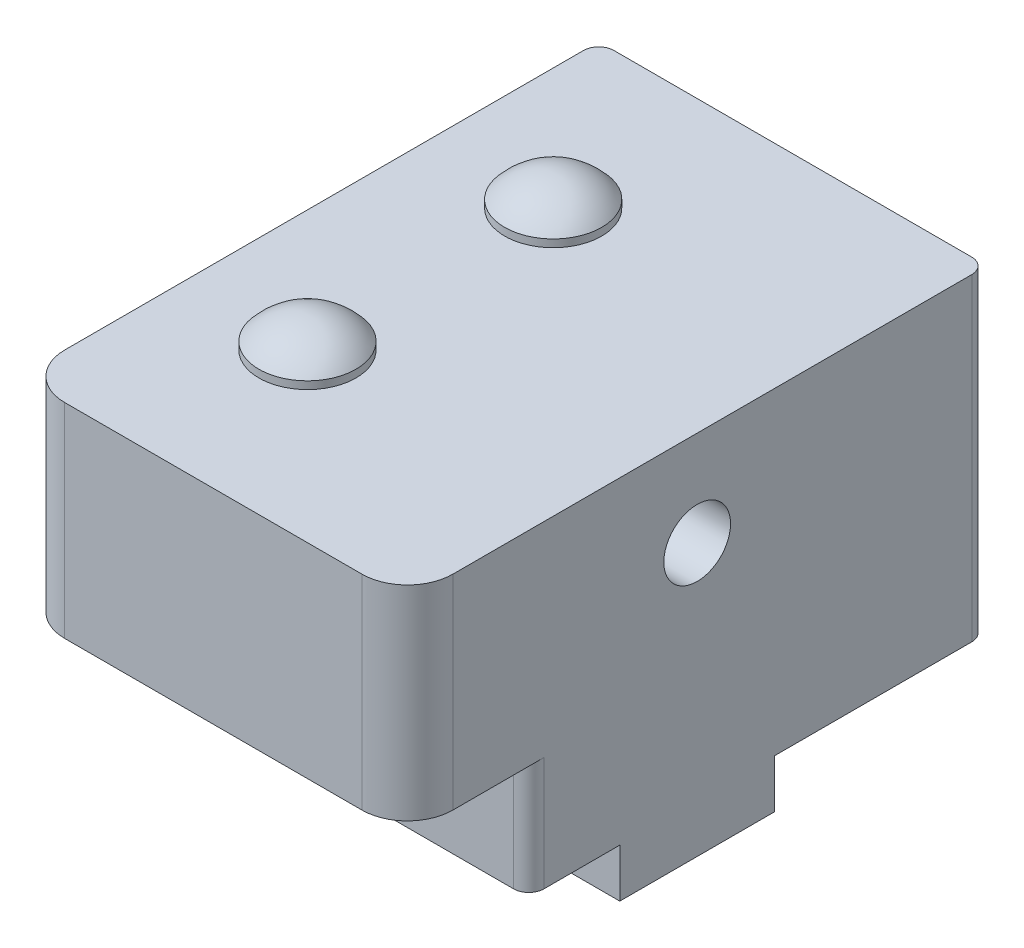
ISO-10303-21;
HEADER;
FILE_DESCRIPTION(('STEP AP214'),'2;1');
FILE_NAME('part.step','',(''),(''),'','','');
FILE_SCHEMA(('AUTOMOTIVE_DESIGN { 1 0 10303 214 1 1 1 1 }'));
ENDSEC;
DATA;
#1=APPLICATION_CONTEXT('core data for automotive mechanical design processes');
#2=APPLICATION_PROTOCOL_DEFINITION('international standard','automotive_design',2000,#1);
#3=PRODUCT_CONTEXT('',#1,'mechanical');
#4=PRODUCT('Part','Part','',(#3));
#5=PRODUCT_RELATED_PRODUCT_CATEGORY('part','',(#4));
#6=PRODUCT_DEFINITION_FORMATION('','',#4);
#7=PRODUCT_DEFINITION_CONTEXT('part definition',#1,'design');
#8=PRODUCT_DEFINITION('design','',#6,#7);
#9=PRODUCT_DEFINITION_SHAPE('','',#8);
#10=(LENGTH_UNIT() NAMED_UNIT(*) SI_UNIT(.MILLI.,.METRE.));
#11=(NAMED_UNIT(*) PLANE_ANGLE_UNIT() SI_UNIT($,.RADIAN.));
#12=(NAMED_UNIT(*) SI_UNIT($,.STERADIAN.) SOLID_ANGLE_UNIT());
#13=UNCERTAINTY_MEASURE_WITH_UNIT(LENGTH_MEASURE(1.E-05),#10,'distance_accuracy_value','');
#14=(GEOMETRIC_REPRESENTATION_CONTEXT(3) GLOBAL_UNCERTAINTY_ASSIGNED_CONTEXT((#13)) GLOBAL_UNIT_ASSIGNED_CONTEXT((#10,
#11,#12)) REPRESENTATION_CONTEXT('',''));
#15=CARTESIAN_POINT('',(0.,0.,0.));
#16=DIRECTION('',(0.,0.,1.));
#17=DIRECTION('',(1.,0.,0.));
#18=AXIS2_PLACEMENT_3D('',#15,#16,#17);
#19=CARTESIAN_POINT('',(0.,0.,0.));
#20=DIRECTION('',(0.,-1.,0.));
#21=DIRECTION('',(0.,0.,-1.));
#22=AXIS2_PLACEMENT_3D('',#19,#20,#21);
#23=PLANE('',#22);
#24=DIRECTION('',(1.,0.,0.));
#25=VECTOR('',#24,1.);
#26=CARTESIAN_POINT('',(0.,0.,-8.));
#27=LINE('',#26,#25);
#28=CARTESIAN_POINT('',(1.,0.,-8.));
#29=VERTEX_POINT('',#28);
#30=CARTESIAN_POINT('',(24.59,0.,-8.));
#31=VERTEX_POINT('',#30);
#32=EDGE_CURVE('E168',#29,#31,#27,.T.);
#33=ORIENTED_EDGE('',*,*,#32,.F.);
#34=CARTESIAN_POINT('',(1.,0.,-9.));
#35=DIRECTION('',(0.,-1.,0.));
#36=DIRECTION('',(0.,0.,-1.));
#37=AXIS2_PLACEMENT_3D('',#34,#35,#36);
#38=CIRCLE('',#37,1.);
#39=CARTESIAN_POINT('',(0.,0.,-9.));
#40=VERTEX_POINT('',#39);
#41=EDGE_CURVE('E193',#29,#40,#38,.T.);
#42=ORIENTED_EDGE('',*,*,#41,.T.);
#43=DIRECTION('',(0.,0.,1.));
#44=VECTOR('',#43,1.);
#45=CARTESIAN_POINT('',(0.,0.,0.));
#46=LINE('',#45,#44);
#47=CARTESIAN_POINT('',(0.,0.,-14.));
#48=VERTEX_POINT('',#47);
#49=EDGE_CURVE('E268',#48,#40,#46,.T.);
#50=ORIENTED_EDGE('',*,*,#49,.F.);
#51=DIRECTION('',(-1.,0.,0.));
#52=VECTOR('',#51,1.);
#53=CARTESIAN_POINT('',(0.,0.,-14.));
#54=LINE('',#53,#52);
#55=CARTESIAN_POINT('',(25.59,0.,-14.));
#56=VERTEX_POINT('',#55);
#57=EDGE_CURVE('E241',#56,#48,#54,.T.);
#58=ORIENTED_EDGE('',*,*,#57,.F.);
#59=DIRECTION('',(0.,0.,-1.));
#60=VECTOR('',#59,1.);
#61=CARTESIAN_POINT('',(25.59,0.,0.));
#62=LINE('',#61,#60);
#63=CARTESIAN_POINT('',(25.59,0.,-9.));
#64=VERTEX_POINT('',#63);
#65=EDGE_CURVE('E284',#64,#56,#62,.T.);
#66=ORIENTED_EDGE('',*,*,#65,.F.);
#67=CARTESIAN_POINT('',(24.59,0.,-9.));
#68=DIRECTION('',(0.,-1.,0.));
#69=DIRECTION('',(0.,0.,-1.));
#70=AXIS2_PLACEMENT_3D('',#67,#68,#69);
#71=CIRCLE('',#70,1.);
#72=EDGE_CURVE('E191',#64,#31,#71,.T.);
#73=ORIENTED_EDGE('',*,*,#72,.T.);
#74=EDGE_LOOP('',(#33,#42,#50,#58,#66,#73));
#75=FACE_BOUND('',#74,.T.);
#76=ADVANCED_FACE('F34',(#75),#23,.T.);
#77=CARTESIAN_POINT('',(0.,20.97,0.));
#78=DIRECTION('',(1.,0.,0.));
#79=DIRECTION('',(0.,0.,-1.));
#80=AXIS2_PLACEMENT_3D('',#77,#78,#79);
#81=PLANE('',#80);
#82=CARTESIAN_POINT('',(0.,14.7,-19.1));
#83=DIRECTION('',(1.,0.,0.));
#84=DIRECTION('',(0.,0.,-1.));
#85=AXIS2_PLACEMENT_3D('',#82,#83,#84);
#86=CIRCLE('',#85,2.2);
#87=CARTESIAN_POINT('',(0.,14.7,-21.3));
#88=VERTEX_POINT('',#87);
#89=EDGE_CURVE('E238',#88,#88,#86,.F.);
#90=ORIENTED_EDGE('',*,*,#89,.F.);
#91=EDGE_LOOP('',(#90));
#92=FACE_BOUND('',#91,.T.);
#93=ORIENTED_EDGE('',*,*,#49,.T.);
#94=DIRECTION('',(0.,-1.,0.));
#95=VECTOR('',#94,1.);
#96=CARTESIAN_POINT('',(0.,20.97,-9.));
#97=LINE('',#96,#95);
#98=CARTESIAN_POINT('',(0.,7.5,-9.));
#99=VERTEX_POINT('',#98);
#100=EDGE_CURVE('E165',#40,#99,#97,.F.);
#101=ORIENTED_EDGE('',*,*,#100,.T.);
#102=DIRECTION('',(0.,0.,-1.));
#103=VECTOR('',#102,1.);
#104=CARTESIAN_POINT('',(0.,7.5,-8.));
#105=LINE('',#104,#103);
#106=CARTESIAN_POINT('',(0.,7.5,-3.));
#107=VERTEX_POINT('',#106);
#108=EDGE_CURVE('E59',#107,#99,#105,.T.);
#109=ORIENTED_EDGE('',*,*,#108,.F.);
#110=DIRECTION('',(0.,-1.,0.));
#111=VECTOR('',#110,1.);
#112=CARTESIAN_POINT('',(0.,20.97,-3.));
#113=LINE('',#112,#111);
#114=CARTESIAN_POINT('',(0.,20.97,-3.));
#115=VERTEX_POINT('',#114);
#116=EDGE_CURVE('E162',#107,#115,#113,.F.);
#117=ORIENTED_EDGE('',*,*,#116,.T.);
#118=DIRECTION('',(0.,0.,1.));
#119=VECTOR('',#118,1.);
#120=CARTESIAN_POINT('',(0.,20.97,0.));
#121=LINE('',#120,#119);
#122=CARTESIAN_POINT('',(0.,20.97,-37.2));
#123=VERTEX_POINT('',#122);
#124=EDGE_CURVE('E269',#123,#115,#121,.T.);
#125=ORIENTED_EDGE('',*,*,#124,.F.);
#126=DIRECTION('',(0.,-1.,0.));
#127=VECTOR('',#126,1.);
#128=CARTESIAN_POINT('',(0.,20.97,-37.2));
#129=LINE('',#128,#127);
#130=CARTESIAN_POINT('',(0.,0.,-37.2));
#131=VERTEX_POINT('',#130);
#132=EDGE_CURVE('E297',#123,#131,#129,.T.);
#133=ORIENTED_EDGE('',*,*,#132,.T.);
#134=CARTESIAN_POINT('',(0.,0.,-24.2));
#135=VERTEX_POINT('',#134);
#136=EDGE_CURVE('E281',#131,#135,#46,.T.);
#137=ORIENTED_EDGE('',*,*,#136,.T.);
#138=DIRECTION('',(0.,1.,0.));
#139=VECTOR('',#138,1.);
#140=CARTESIAN_POINT('',(0.,-3.2,-24.2));
#141=LINE('',#140,#139);
#142=CARTESIAN_POINT('',(0.,-3.2,-24.2));
#143=VERTEX_POINT('',#142);
#144=EDGE_CURVE('E262',#143,#135,#141,.T.);
#145=ORIENTED_EDGE('',*,*,#144,.F.);
#146=DIRECTION('',(0.,0.,-1.));
#147=VECTOR('',#146,1.);
#148=CARTESIAN_POINT('',(0.,-3.2,-24.2));
#149=LINE('',#148,#147);
#150=CARTESIAN_POINT('',(0.,-3.2,-14.));
#151=VERTEX_POINT('',#150);
#152=EDGE_CURVE('E245',#151,#143,#149,.T.);
#153=ORIENTED_EDGE('',*,*,#152,.F.);
#154=DIRECTION('',(0.,1.,0.));
#155=VECTOR('',#154,1.);
#156=CARTESIAN_POINT('',(0.,-3.2,-14.));
#157=LINE('',#156,#155);
#158=EDGE_CURVE('E265',#151,#48,#157,.T.);
#159=ORIENTED_EDGE('',*,*,#158,.T.);
#160=EDGE_LOOP('',(#93,#101,#109,#117,#125,#133,#137,#145,#153,#159));
#161=FACE_BOUND('',#160,.T.);
#162=ADVANCED_FACE('F160',(#92,#161),#81,.F.);
#163=CARTESIAN_POINT('',(0.,20.97,0.));
#164=DIRECTION('',(0.,0.,-1.));
#165=DIRECTION('',(-1.,0.,0.));
#166=AXIS2_PLACEMENT_3D('',#163,#164,#165);
#167=PLANE('',#166);
#168=DIRECTION('',(0.,-1.,0.));
#169=VECTOR('',#168,1.);
#170=CARTESIAN_POINT('',(3.,20.97,0.));
#171=LINE('',#170,#169);
#172=CARTESIAN_POINT('',(3.,20.97,0.));
#173=VERTEX_POINT('',#172);
#174=CARTESIAN_POINT('',(3.,7.5,0.));
#175=VERTEX_POINT('',#174);
#176=EDGE_CURVE('E174',#173,#175,#171,.T.);
#177=ORIENTED_EDGE('',*,*,#176,.T.);
#178=DIRECTION('',(-1.,0.,0.));
#179=VECTOR('',#178,1.);
#180=CARTESIAN_POINT('',(0.,7.5,0.));
#181=LINE('',#180,#179);
#182=CARTESIAN_POINT('',(22.59,7.5,0.));
#183=VERTEX_POINT('',#182);
#184=EDGE_CURVE('E151',#183,#175,#181,.T.);
#185=ORIENTED_EDGE('',*,*,#184,.F.);
#186=DIRECTION('',(0.,-1.,0.));
#187=VECTOR('',#186,1.);
#188=CARTESIAN_POINT('',(22.59,20.97,0.));
#189=LINE('',#188,#187);
#190=CARTESIAN_POINT('',(22.59,20.97,0.));
#191=VERTEX_POINT('',#190);
#192=EDGE_CURVE('E177',#183,#191,#189,.F.);
#193=ORIENTED_EDGE('',*,*,#192,.T.);
#194=DIRECTION('',(1.,0.,0.));
#195=VECTOR('',#194,1.);
#196=CARTESIAN_POINT('',(0.,20.97,0.));
#197=LINE('',#196,#195);
#198=EDGE_CURVE('E271',#173,#191,#197,.T.);
#199=ORIENTED_EDGE('',*,*,#198,.F.);
#200=EDGE_LOOP('',(#177,#185,#193,#199));
#201=FACE_BOUND('',#200,.T.);
#202=ADVANCED_FACE('F308',(#201),#167,.F.);
#203=CARTESIAN_POINT('',(25.59,20.97,0.));
#204=DIRECTION('',(-1.,0.,0.));
#205=DIRECTION('',(0.,0.,1.));
#206=AXIS2_PLACEMENT_3D('',#203,#204,#205);
#207=PLANE('',#206);
#208=CARTESIAN_POINT('',(25.59,14.7,-19.1));
#209=DIRECTION('',(1.,0.,0.));
#210=DIRECTION('',(0.,0.,-1.));
#211=AXIS2_PLACEMENT_3D('',#208,#209,#210);
#212=CIRCLE('',#211,2.2);
#213=CARTESIAN_POINT('',(25.59,14.7,-21.3));
#214=VERTEX_POINT('',#213);
#215=EDGE_CURVE('E227',#214,#214,#212,.T.);
#216=ORIENTED_EDGE('',*,*,#215,.F.);
#217=EDGE_LOOP('',(#216));
#218=FACE_BOUND('',#217,.T.);
#219=DIRECTION('',(0.,0.,1.));
#220=VECTOR('',#219,1.);
#221=CARTESIAN_POINT('',(25.59,7.5,-8.));
#222=LINE('',#221,#220);
#223=CARTESIAN_POINT('',(25.59,7.5,-9.));
#224=VERTEX_POINT('',#223);
#225=CARTESIAN_POINT('',(25.59,7.5,-3.));
#226=VERTEX_POINT('',#225);
#227=EDGE_CURVE('E51',#224,#226,#222,.T.);
#228=ORIENTED_EDGE('',*,*,#227,.F.);
#229=DIRECTION('',(0.,-1.,0.));
#230=VECTOR('',#229,1.);
#231=CARTESIAN_POINT('',(25.59,20.97,-9.));
#232=LINE('',#231,#230);
#233=EDGE_CURVE('E196',#224,#64,#232,.T.);
#234=ORIENTED_EDGE('',*,*,#233,.T.);
#235=ORIENTED_EDGE('',*,*,#65,.T.);
#236=DIRECTION('',(0.,1.,0.));
#237=VECTOR('',#236,1.);
#238=CARTESIAN_POINT('',(25.59,-3.2,-14.));
#239=LINE('',#238,#237);
#240=CARTESIAN_POINT('',(25.59,-3.2,-14.));
#241=VERTEX_POINT('',#240);
#242=EDGE_CURVE('E252',#241,#56,#239,.T.);
#243=ORIENTED_EDGE('',*,*,#242,.F.);
#244=DIRECTION('',(0.,0.,1.));
#245=VECTOR('',#244,1.);
#246=CARTESIAN_POINT('',(25.59,-3.2,-14.));
#247=LINE('',#246,#245);
#248=CARTESIAN_POINT('',(25.59,-3.2,-24.2));
#249=VERTEX_POINT('',#248);
#250=EDGE_CURVE('E250',#249,#241,#247,.T.);
#251=ORIENTED_EDGE('',*,*,#250,.F.);
#252=DIRECTION('',(0.,1.,0.));
#253=VECTOR('',#252,1.);
#254=CARTESIAN_POINT('',(25.59,-3.2,-24.2));
#255=LINE('',#254,#253);
#256=CARTESIAN_POINT('',(25.59,0.,-24.2));
#257=VERTEX_POINT('',#256);
#258=EDGE_CURVE('E259',#249,#257,#255,.T.);
#259=ORIENTED_EDGE('',*,*,#258,.T.);
#260=CARTESIAN_POINT('',(25.59,0.,-37.2));
#261=VERTEX_POINT('',#260);
#262=EDGE_CURVE('E283',#257,#261,#62,.T.);
#263=ORIENTED_EDGE('',*,*,#262,.T.);
#264=DIRECTION('',(0.,-1.,0.));
#265=VECTOR('',#264,1.);
#266=CARTESIAN_POINT('',(25.59,20.97,-37.2));
#267=LINE('',#266,#265);
#268=CARTESIAN_POINT('',(25.59,20.97,-37.2));
#269=VERTEX_POINT('',#268);
#270=EDGE_CURVE('E292',#261,#269,#267,.F.);
#271=ORIENTED_EDGE('',*,*,#270,.T.);
#272=DIRECTION('',(0.,0.,-1.));
#273=VECTOR('',#272,1.);
#274=CARTESIAN_POINT('',(25.59,20.97,0.));
#275=LINE('',#274,#273);
#276=CARTESIAN_POINT('',(25.59,20.97,-3.));
#277=VERTEX_POINT('',#276);
#278=EDGE_CURVE('E275',#277,#269,#275,.T.);
#279=ORIENTED_EDGE('',*,*,#278,.F.);
#280=DIRECTION('',(0.,-1.,0.));
#281=VECTOR('',#280,1.);
#282=CARTESIAN_POINT('',(25.59,20.97,-3.));
#283=LINE('',#282,#281);
#284=EDGE_CURVE('E182',#277,#226,#283,.T.);
#285=ORIENTED_EDGE('',*,*,#284,.T.);
#286=EDGE_LOOP('',(#228,#234,#235,#243,#251,#259,#263,#271,#279,#285));
#287=FACE_BOUND('',#286,.T.);
#288=ADVANCED_FACE('F317',(#218,#287),#207,.F.);
#289=CARTESIAN_POINT('',(0.,20.97,-38.2));
#290=DIRECTION('',(0.,0.,1.));
#291=DIRECTION('',(1.,0.,0.));
#292=AXIS2_PLACEMENT_3D('',#289,#290,#291);
#293=PLANE('',#292);
#294=CARTESIAN_POINT('',(3.,17.47,-38.2));
#295=DIRECTION('',(0.,0.,1.));
#296=DIRECTION('',(1.,0.,0.));
#297=AXIS2_PLACEMENT_3D('',#294,#295,#296);
#298=CIRCLE('',#297,1.25);
#299=CARTESIAN_POINT('',(4.25,17.47,-38.2));
#300=VERTEX_POINT('',#299);
#301=EDGE_CURVE('E212',#300,#300,#298,.T.);
#302=ORIENTED_EDGE('',*,*,#301,.T.);
#303=EDGE_LOOP('',(#302));
#304=FACE_BOUND('',#303,.T.);
#305=CARTESIAN_POINT('',(3.,4.5,-38.2));
#306=DIRECTION('',(0.,0.,1.));
#307=DIRECTION('',(1.,0.,0.));
#308=AXIS2_PLACEMENT_3D('',#305,#306,#307);
#309=CIRCLE('',#308,1.25);
#310=CARTESIAN_POINT('',(4.25,4.5,-38.2));
#311=VERTEX_POINT('',#310);
#312=EDGE_CURVE('E215',#311,#311,#309,.T.);
#313=ORIENTED_EDGE('',*,*,#312,.T.);
#314=EDGE_LOOP('',(#313));
#315=FACE_BOUND('',#314,.T.);
#316=CARTESIAN_POINT('',(22.59,17.47,-38.2));
#317=DIRECTION('',(0.,0.,-1.));
#318=DIRECTION('',(-1.,0.,0.));
#319=AXIS2_PLACEMENT_3D('',#316,#317,#318);
#320=CIRCLE('',#319,1.25);
#321=CARTESIAN_POINT('',(21.34,17.47,-38.2));
#322=VERTEX_POINT('',#321);
#323=EDGE_CURVE('E228',#322,#322,#320,.T.);
#324=ORIENTED_EDGE('',*,*,#323,.F.);
#325=EDGE_LOOP('',(#324));
#326=FACE_BOUND('',#325,.T.);
#327=CARTESIAN_POINT('',(22.59,4.5,-38.2));
#328=DIRECTION('',(0.,0.,-1.));
#329=DIRECTION('',(-1.,0.,0.));
#330=AXIS2_PLACEMENT_3D('',#327,#328,#329);
#331=CIRCLE('',#330,1.25);
#332=CARTESIAN_POINT('',(21.34,4.5,-38.2));
#333=VERTEX_POINT('',#332);
#334=EDGE_CURVE('E156',#333,#333,#331,.T.);
#335=ORIENTED_EDGE('',*,*,#334,.F.);
#336=EDGE_LOOP('',(#335));
#337=FACE_BOUND('',#336,.T.);
#338=DIRECTION('',(-1.,0.,0.));
#339=VECTOR('',#338,1.);
#340=CARTESIAN_POINT('',(0.,0.,-38.2));
#341=LINE('',#340,#339);
#342=CARTESIAN_POINT('',(24.59,0.,-38.2));
#343=VERTEX_POINT('',#342);
#344=CARTESIAN_POINT('',(1.,0.,-38.2));
#345=VERTEX_POINT('',#344);
#346=EDGE_CURVE('E272',#343,#345,#341,.T.);
#347=ORIENTED_EDGE('',*,*,#346,.T.);
#348=DIRECTION('',(0.,-1.,0.));
#349=VECTOR('',#348,1.);
#350=CARTESIAN_POINT('',(1.,20.97,-38.2));
#351=LINE('',#350,#349);
#352=CARTESIAN_POINT('',(1.,20.97,-38.2));
#353=VERTEX_POINT('',#352);
#354=EDGE_CURVE('E302',#345,#353,#351,.F.);
#355=ORIENTED_EDGE('',*,*,#354,.T.);
#356=DIRECTION('',(-1.,0.,0.));
#357=VECTOR('',#356,1.);
#358=CARTESIAN_POINT('',(0.,20.97,-38.2));
#359=LINE('',#358,#357);
#360=CARTESIAN_POINT('',(24.59,20.97,-38.2));
#361=VERTEX_POINT('',#360);
#362=EDGE_CURVE('E277',#361,#353,#359,.T.);
#363=ORIENTED_EDGE('',*,*,#362,.F.);
#364=DIRECTION('',(0.,-1.,0.));
#365=VECTOR('',#364,1.);
#366=CARTESIAN_POINT('',(24.59,20.97,-38.2));
#367=LINE('',#366,#365);
#368=EDGE_CURVE('E280',#361,#343,#367,.T.);
#369=ORIENTED_EDGE('',*,*,#368,.T.);
#370=EDGE_LOOP('',(#347,#355,#363,#369));
#371=FACE_BOUND('',#370,.T.);
#372=ADVANCED_FACE('F326',(#304,#315,#326,#337,#371),#293,.F.);
#373=CARTESIAN_POINT('',(0.,20.97,0.));
#374=DIRECTION('',(0.,-1.,0.));
#375=DIRECTION('',(0.,0.,-1.));
#376=AXIS2_PLACEMENT_3D('',#373,#374,#375);
#377=PLANE('',#376);
#378=CARTESIAN_POINT('',(8.,20.97,-11.));
#379=DIRECTION('',(0.,-1.,0.));
#380=DIRECTION('',(0.,0.,-1.));
#381=AXIS2_PLACEMENT_3D('',#378,#379,#380);
#382=CIRCLE('',#381,3.2);
#383=CARTESIAN_POINT('',(8.,20.97,-14.2));
#384=VERTEX_POINT('',#383);
#385=EDGE_CURVE('E202',#384,#384,#382,.T.);
#386=ORIENTED_EDGE('',*,*,#385,.T.);
#387=EDGE_LOOP('',(#386));
#388=FACE_BOUND('',#387,.T.);
#389=CARTESIAN_POINT('',(8.,20.97,-27.2));
#390=DIRECTION('',(0.,-1.,0.));
#391=DIRECTION('',(0.,0.,-1.));
#392=AXIS2_PLACEMENT_3D('',#389,#390,#391);
#393=CIRCLE('',#392,3.2);
#394=CARTESIAN_POINT('',(8.,20.97,-30.4));
#395=VERTEX_POINT('',#394);
#396=EDGE_CURVE('E11',#395,#395,#393,.F.);
#397=ORIENTED_EDGE('',*,*,#396,.F.);
#398=EDGE_LOOP('',(#397));
#399=FACE_BOUND('',#398,.T.);
#400=ORIENTED_EDGE('',*,*,#124,.T.);
#401=CARTESIAN_POINT('',(3.,20.97,-3.));
#402=DIRECTION('',(0.,-1.,0.));
#403=DIRECTION('',(0.,0.,-1.));
#404=AXIS2_PLACEMENT_3D('',#401,#402,#403);
#405=CIRCLE('',#404,3.);
#406=EDGE_CURVE('E172',#115,#173,#405,.F.);
#407=ORIENTED_EDGE('',*,*,#406,.T.);
#408=ORIENTED_EDGE('',*,*,#198,.T.);
#409=CARTESIAN_POINT('',(22.59,20.97,-3.));
#410=DIRECTION('',(0.,-1.,0.));
#411=DIRECTION('',(0.,0.,-1.));
#412=AXIS2_PLACEMENT_3D('',#409,#410,#411);
#413=CIRCLE('',#412,3.);
#414=EDGE_CURVE('E173',#191,#277,#413,.F.);
#415=ORIENTED_EDGE('',*,*,#414,.T.);
#416=ORIENTED_EDGE('',*,*,#278,.T.);
#417=CARTESIAN_POINT('',(24.59,20.97,-37.2));
#418=DIRECTION('',(0.,-1.,0.));
#419=DIRECTION('',(0.,0.,-1.));
#420=AXIS2_PLACEMENT_3D('',#417,#418,#419);
#421=CIRCLE('',#420,1.);
#422=EDGE_CURVE('E295',#269,#361,#421,.F.);
#423=ORIENTED_EDGE('',*,*,#422,.T.);
#424=ORIENTED_EDGE('',*,*,#362,.T.);
#425=CARTESIAN_POINT('',(1.,20.97,-37.2));
#426=DIRECTION('',(0.,-1.,0.));
#427=DIRECTION('',(0.,0.,-1.));
#428=AXIS2_PLACEMENT_3D('',#425,#426,#427);
#429=CIRCLE('',#428,1.);
#430=EDGE_CURVE('E304',#353,#123,#429,.F.);
#431=ORIENTED_EDGE('',*,*,#430,.T.);
#432=EDGE_LOOP('',(#400,#407,#408,#415,#416,#423,#424,#431));
#433=FACE_BOUND('',#432,.T.);
#434=ADVANCED_FACE('F313',(#388,#399,#433),#377,.F.);
#435=ORIENTED_EDGE('',*,*,#136,.F.);
#436=CARTESIAN_POINT('',(1.,0.,-37.2));
#437=DIRECTION('',(0.,-1.,0.));
#438=DIRECTION('',(0.,0.,-1.));
#439=AXIS2_PLACEMENT_3D('',#436,#437,#438);
#440=CIRCLE('',#439,1.);
#441=EDGE_CURVE('E300',#131,#345,#440,.T.);
#442=ORIENTED_EDGE('',*,*,#441,.T.);
#443=ORIENTED_EDGE('',*,*,#346,.F.);
#444=CARTESIAN_POINT('',(24.59,0.,-37.2));
#445=DIRECTION('',(0.,-1.,0.));
#446=DIRECTION('',(0.,0.,-1.));
#447=AXIS2_PLACEMENT_3D('',#444,#445,#446);
#448=CIRCLE('',#447,1.);
#449=EDGE_CURVE('E290',#343,#261,#448,.T.);
#450=ORIENTED_EDGE('',*,*,#449,.T.);
#451=ORIENTED_EDGE('',*,*,#262,.F.);
#452=DIRECTION('',(1.,0.,0.));
#453=VECTOR('',#452,1.);
#454=CARTESIAN_POINT('',(0.,0.,-24.2));
#455=LINE('',#454,#453);
#456=EDGE_CURVE('E246',#135,#257,#455,.T.);
#457=ORIENTED_EDGE('',*,*,#456,.F.);
#458=EDGE_LOOP('',(#435,#442,#443,#450,#451,#457));
#459=FACE_BOUND('',#458,.T.);
#460=ADVANCED_FACE('F332',(#459),#23,.T.);
#461=CARTESIAN_POINT('',(0.,-3.2,-14.));
#462=DIRECTION('',(0.,0.,-1.));
#463=DIRECTION('',(-1.,0.,0.));
#464=AXIS2_PLACEMENT_3D('',#461,#462,#463);
#465=PLANE('',#464);
#466=ORIENTED_EDGE('',*,*,#57,.T.);
#467=ORIENTED_EDGE('',*,*,#158,.F.);
#468=DIRECTION('',(-1.,0.,0.));
#469=VECTOR('',#468,1.);
#470=CARTESIAN_POINT('',(0.,-3.2,-14.));
#471=LINE('',#470,#469);
#472=EDGE_CURVE('E242',#241,#151,#471,.T.);
#473=ORIENTED_EDGE('',*,*,#472,.F.);
#474=ORIENTED_EDGE('',*,*,#242,.T.);
#475=EDGE_LOOP('',(#466,#467,#473,#474));
#476=FACE_BOUND('',#475,.T.);
#477=ADVANCED_FACE('F365',(#476),#465,.F.);
#478=CARTESIAN_POINT('',(0.,-3.2,-24.2));
#479=DIRECTION('',(0.,0.,1.));
#480=DIRECTION('',(1.,0.,0.));
#481=AXIS2_PLACEMENT_3D('',#478,#479,#480);
#482=PLANE('',#481);
#483=ORIENTED_EDGE('',*,*,#456,.T.);
#484=ORIENTED_EDGE('',*,*,#258,.F.);
#485=DIRECTION('',(1.,0.,0.));
#486=VECTOR('',#485,1.);
#487=CARTESIAN_POINT('',(0.,-3.2,-24.2));
#488=LINE('',#487,#486);
#489=EDGE_CURVE('E248',#143,#249,#488,.T.);
#490=ORIENTED_EDGE('',*,*,#489,.F.);
#491=ORIENTED_EDGE('',*,*,#144,.T.);
#492=EDGE_LOOP('',(#483,#484,#490,#491));
#493=FACE_BOUND('',#492,.T.);
#494=ADVANCED_FACE('F339',(#493),#482,.F.);
#495=CARTESIAN_POINT('',(0.,-3.2,0.));
#496=DIRECTION('',(0.,1.,0.));
#497=DIRECTION('',(0.,0.,1.));
#498=AXIS2_PLACEMENT_3D('',#495,#496,#497);
#499=PLANE('',#498);
#500=ORIENTED_EDGE('',*,*,#472,.T.);
#501=ORIENTED_EDGE('',*,*,#152,.T.);
#502=ORIENTED_EDGE('',*,*,#489,.T.);
#503=ORIENTED_EDGE('',*,*,#250,.T.);
#504=EDGE_LOOP('',(#500,#501,#502,#503));
#505=FACE_BOUND('',#504,.T.);
#506=ADVANCED_FACE('F380',(#505),#499,.F.);
#507=CARTESIAN_POINT('',(-6.22253967444162,14.7,-19.1));
#508=DIRECTION('',(1.,0.,0.));
#509=DIRECTION('',(0.,0.,-1.));
#510=AXIS2_PLACEMENT_3D('',#507,#508,#509);
#511=CYLINDRICAL_SURFACE('',#510,2.2);
#512=ORIENTED_EDGE('',*,*,#89,.T.);
#513=EDGE_LOOP('',(#512));
#514=FACE_BOUND('',#513,.T.);
#515=ORIENTED_EDGE('',*,*,#215,.T.);
#516=EDGE_LOOP('',(#515));
#517=FACE_BOUND('',#516,.T.);
#518=ADVANCED_FACE('F383',(#514,#517),#511,.F.);
#519=CARTESIAN_POINT('',(22.59,4.5,-33.2));
#520=DIRECTION('',(0.,0.,-1.));
#521=DIRECTION('',(-1.,0.,0.));
#522=AXIS2_PLACEMENT_3D('',#519,#520,#521);
#523=CYLINDRICAL_SURFACE('',#522,1.25);
#524=CARTESIAN_POINT('',(22.59,4.5,-33.2));
#525=DIRECTION('',(0.,0.,-1.));
#526=DIRECTION('',(-1.,0.,0.));
#527=AXIS2_PLACEMENT_3D('',#524,#525,#526);
#528=CIRCLE('',#527,1.25);
#529=CARTESIAN_POINT('',(21.34,4.5,-33.2));
#530=VERTEX_POINT('',#529);
#531=EDGE_CURVE('E231',#530,#530,#528,.T.);
#532=ORIENTED_EDGE('',*,*,#531,.F.);
#533=EDGE_LOOP('',(#532));
#534=FACE_BOUND('',#533,.T.);
#535=ORIENTED_EDGE('',*,*,#334,.T.);
#536=EDGE_LOOP('',(#535));
#537=FACE_BOUND('',#536,.T.);
#538=ADVANCED_FACE('F387',(#534,#537),#523,.F.);
#539=CARTESIAN_POINT('',(22.59,4.5,-33.2));
#540=DIRECTION('',(0.,0.,-1.));
#541=DIRECTION('',(-1.,0.,0.));
#542=AXIS2_PLACEMENT_3D('',#539,#540,#541);
#543=PLANE('',#542);
#544=ORIENTED_EDGE('',*,*,#531,.T.);
#545=EDGE_LOOP('',(#544));
#546=FACE_BOUND('',#545,.T.);
#547=ADVANCED_FACE('F391',(#546),#543,.T.);
#548=CARTESIAN_POINT('',(22.59,17.47,-33.2));
#549=DIRECTION('',(0.,0.,-1.));
#550=DIRECTION('',(-1.,0.,0.));
#551=AXIS2_PLACEMENT_3D('',#548,#549,#550);
#552=CYLINDRICAL_SURFACE('',#551,1.25);
#553=CARTESIAN_POINT('',(22.59,17.47,-33.2));
#554=DIRECTION('',(0.,0.,-1.));
#555=DIRECTION('',(-1.,0.,0.));
#556=AXIS2_PLACEMENT_3D('',#553,#554,#555);
#557=CIRCLE('',#556,1.25);
#558=CARTESIAN_POINT('',(21.34,17.47,-33.2));
#559=VERTEX_POINT('',#558);
#560=EDGE_CURVE('E224',#559,#559,#557,.T.);
#561=ORIENTED_EDGE('',*,*,#560,.F.);
#562=EDGE_LOOP('',(#561));
#563=FACE_BOUND('',#562,.T.);
#564=ORIENTED_EDGE('',*,*,#323,.T.);
#565=EDGE_LOOP('',(#564));
#566=FACE_BOUND('',#565,.T.);
#567=ADVANCED_FACE('F395',(#563,#566),#552,.F.);
#568=CARTESIAN_POINT('',(22.59,17.47,-33.2));
#569=DIRECTION('',(0.,0.,-1.));
#570=DIRECTION('',(-1.,0.,0.));
#571=AXIS2_PLACEMENT_3D('',#568,#569,#570);
#572=PLANE('',#571);
#573=ORIENTED_EDGE('',*,*,#560,.T.);
#574=EDGE_LOOP('',(#573));
#575=FACE_BOUND('',#574,.T.);
#576=ADVANCED_FACE('F351',(#575),#572,.T.);
#577=CARTESIAN_POINT('',(24.59,20.97,-37.2));
#578=DIRECTION('',(0.,-1.,0.));
#579=DIRECTION('',(0.,0.,-1.));
#580=AXIS2_PLACEMENT_3D('',#577,#578,#579);
#581=CYLINDRICAL_SURFACE('',#580,1.);
#582=ORIENTED_EDGE('',*,*,#422,.F.);
#583=ORIENTED_EDGE('',*,*,#270,.F.);
#584=ORIENTED_EDGE('',*,*,#449,.F.);
#585=ORIENTED_EDGE('',*,*,#368,.F.);
#586=EDGE_LOOP('',(#582,#583,#584,#585));
#587=FACE_BOUND('',#586,.T.);
#588=ADVANCED_FACE('F329',(#587),#581,.T.);
#589=CARTESIAN_POINT('',(1.,20.97,-37.2));
#590=DIRECTION('',(0.,-1.,0.));
#591=DIRECTION('',(0.,0.,-1.));
#592=AXIS2_PLACEMENT_3D('',#589,#590,#591);
#593=CYLINDRICAL_SURFACE('',#592,1.);
#594=ORIENTED_EDGE('',*,*,#430,.F.);
#595=ORIENTED_EDGE('',*,*,#354,.F.);
#596=ORIENTED_EDGE('',*,*,#441,.F.);
#597=ORIENTED_EDGE('',*,*,#132,.F.);
#598=EDGE_LOOP('',(#594,#595,#596,#597));
#599=FACE_BOUND('',#598,.T.);
#600=ADVANCED_FACE('F343',(#599),#593,.T.);
#601=CARTESIAN_POINT('',(3.,20.97,-3.));
#602=DIRECTION('',(0.,-1.,0.));
#603=DIRECTION('',(0.,0.,-1.));
#604=AXIS2_PLACEMENT_3D('',#601,#602,#603);
#605=CYLINDRICAL_SURFACE('',#604,3.);
#606=CARTESIAN_POINT('',(3.,7.5,-3.));
#607=DIRECTION('',(0.,1.,0.));
#608=DIRECTION('',(0.,0.,1.));
#609=AXIS2_PLACEMENT_3D('',#606,#607,#608);
#610=CIRCLE('',#609,3.);
#611=EDGE_CURVE('E148',#175,#107,#610,.F.);
#612=ORIENTED_EDGE('',*,*,#611,.F.);
#613=ORIENTED_EDGE('',*,*,#176,.F.);
#614=ORIENTED_EDGE('',*,*,#406,.F.);
#615=ORIENTED_EDGE('',*,*,#116,.F.);
#616=EDGE_LOOP('',(#612,#613,#614,#615));
#617=FACE_BOUND('',#616,.T.);
#618=ADVANCED_FACE('F171',(#617),#605,.T.);
#619=CARTESIAN_POINT('',(22.59,20.97,-3.));
#620=DIRECTION('',(0.,-1.,0.));
#621=DIRECTION('',(0.,0.,-1.));
#622=AXIS2_PLACEMENT_3D('',#619,#620,#621);
#623=CYLINDRICAL_SURFACE('',#622,3.);
#624=CARTESIAN_POINT('',(22.59,7.5,-3.));
#625=DIRECTION('',(0.,1.,0.));
#626=DIRECTION('',(0.,0.,1.));
#627=AXIS2_PLACEMENT_3D('',#624,#625,#626);
#628=CIRCLE('',#627,3.);
#629=EDGE_CURVE('E184',#226,#183,#628,.F.);
#630=ORIENTED_EDGE('',*,*,#629,.F.);
#631=ORIENTED_EDGE('',*,*,#284,.F.);
#632=ORIENTED_EDGE('',*,*,#414,.F.);
#633=ORIENTED_EDGE('',*,*,#192,.F.);
#634=EDGE_LOOP('',(#630,#631,#632,#633));
#635=FACE_BOUND('',#634,.T.);
#636=ADVANCED_FACE('F316',(#635),#623,.T.);
#637=CARTESIAN_POINT('',(0.,7.5,-8.));
#638=DIRECTION('',(0.,0.,-1.));
#639=DIRECTION('',(-1.,0.,0.));
#640=AXIS2_PLACEMENT_3D('',#637,#638,#639);
#641=PLANE('',#640);
#642=DIRECTION('',(1.,0.,0.));
#643=VECTOR('',#642,1.);
#644=CARTESIAN_POINT('',(0.,7.5,-8.));
#645=LINE('',#644,#643);
#646=CARTESIAN_POINT('',(1.,7.5,-8.));
#647=VERTEX_POINT('',#646);
#648=CARTESIAN_POINT('',(24.59,7.5,-8.));
#649=VERTEX_POINT('',#648);
#650=EDGE_CURVE('E167',#647,#649,#645,.T.);
#651=ORIENTED_EDGE('',*,*,#650,.F.);
#652=DIRECTION('',(0.,-1.,0.));
#653=VECTOR('',#652,1.);
#654=CARTESIAN_POINT('',(1.,7.5,-8.));
#655=LINE('',#654,#653);
#656=EDGE_CURVE('E188',#647,#29,#655,.T.);
#657=ORIENTED_EDGE('',*,*,#656,.T.);
#658=ORIENTED_EDGE('',*,*,#32,.T.);
#659=DIRECTION('',(0.,-1.,0.));
#660=VECTOR('',#659,1.);
#661=CARTESIAN_POINT('',(24.59,7.5,-8.));
#662=LINE('',#661,#660);
#663=EDGE_CURVE('E186',#31,#649,#662,.F.);
#664=ORIENTED_EDGE('',*,*,#663,.T.);
#665=EDGE_LOOP('',(#651,#657,#658,#664));
#666=FACE_BOUND('',#665,.T.);
#667=ADVANCED_FACE('F403',(#666),#641,.F.);
#668=CARTESIAN_POINT('',(0.,7.5,0.));
#669=DIRECTION('',(0.,1.,0.));
#670=DIRECTION('',(0.,0.,1.));
#671=AXIS2_PLACEMENT_3D('',#668,#669,#670);
#672=PLANE('',#671);
#673=ORIENTED_EDGE('',*,*,#611,.T.);
#674=ORIENTED_EDGE('',*,*,#108,.T.);
#675=CARTESIAN_POINT('',(1.,7.5,-9.));
#676=DIRECTION('',(0.,1.,0.));
#677=DIRECTION('',(0.,0.,1.));
#678=AXIS2_PLACEMENT_3D('',#675,#676,#677);
#679=CIRCLE('',#678,1.);
#680=EDGE_CURVE('E198',#99,#647,#679,.T.);
#681=ORIENTED_EDGE('',*,*,#680,.T.);
#682=ORIENTED_EDGE('',*,*,#650,.T.);
#683=CARTESIAN_POINT('',(24.59,7.5,-9.));
#684=DIRECTION('',(0.,1.,0.));
#685=DIRECTION('',(0.,0.,1.));
#686=AXIS2_PLACEMENT_3D('',#683,#684,#685);
#687=CIRCLE('',#686,1.);
#688=EDGE_CURVE('E43',#649,#224,#687,.T.);
#689=ORIENTED_EDGE('',*,*,#688,.T.);
#690=ORIENTED_EDGE('',*,*,#227,.T.);
#691=ORIENTED_EDGE('',*,*,#629,.T.);
#692=ORIENTED_EDGE('',*,*,#184,.T.);
#693=EDGE_LOOP('',(#673,#674,#681,#682,#689,#690,#691,#692));
#694=FACE_BOUND('',#693,.T.);
#695=ADVANCED_FACE('F149',(#694),#672,.F.);
#696=CARTESIAN_POINT('',(1.,7.5,-9.));
#697=DIRECTION('',(0.,-1.,0.));
#698=DIRECTION('',(0.,0.,-1.));
#699=AXIS2_PLACEMENT_3D('',#696,#697,#698);
#700=CYLINDRICAL_SURFACE('',#699,1.);
#701=ORIENTED_EDGE('',*,*,#680,.F.);
#702=ORIENTED_EDGE('',*,*,#100,.F.);
#703=ORIENTED_EDGE('',*,*,#41,.F.);
#704=ORIENTED_EDGE('',*,*,#656,.F.);
#705=EDGE_LOOP('',(#701,#702,#703,#704));
#706=FACE_BOUND('',#705,.T.);
#707=ADVANCED_FACE('F409',(#706),#700,.T.);
#708=CARTESIAN_POINT('',(24.59,20.97,-9.));
#709=DIRECTION('',(0.,-1.,0.));
#710=DIRECTION('',(0.,0.,-1.));
#711=AXIS2_PLACEMENT_3D('',#708,#709,#710);
#712=CYLINDRICAL_SURFACE('',#711,1.);
#713=ORIENTED_EDGE('',*,*,#688,.F.);
#714=ORIENTED_EDGE('',*,*,#663,.F.);
#715=ORIENTED_EDGE('',*,*,#72,.F.);
#716=ORIENTED_EDGE('',*,*,#233,.F.);
#717=EDGE_LOOP('',(#713,#714,#715,#716));
#718=FACE_BOUND('',#717,.T.);
#719=ADVANCED_FACE('F413',(#718),#712,.T.);
#720=CARTESIAN_POINT('',(8.,21.47,-27.2));
#721=DIRECTION('',(0.,-1.,0.));
#722=DIRECTION('',(0.,0.,-1.));
#723=AXIS2_PLACEMENT_3D('',#720,#721,#722);
#724=CYLINDRICAL_SURFACE('',#723,3.2);
#725=CARTESIAN_POINT('',(8.,21.47,-27.2));
#726=DIRECTION('',(0.,1.,0.));
#727=DIRECTION('',(0.,0.,1.));
#728=AXIS2_PLACEMENT_3D('',#725,#726,#727);
#729=CIRCLE('',#728,3.2);
#730=CARTESIAN_POINT('',(8.,21.47,-24.));
#731=VERTEX_POINT('',#730);
#732=EDGE_CURVE('E38',#731,#731,#729,.T.);
#733=ORIENTED_EDGE('',*,*,#732,.F.);
#734=EDGE_LOOP('',(#733));
#735=FACE_BOUND('',#734,.T.);
#736=ORIENTED_EDGE('',*,*,#396,.T.);
#737=EDGE_LOOP('',(#736));
#738=FACE_BOUND('',#737,.T.);
#739=ADVANCED_FACE('F410',(#735,#738),#724,.T.);
#740=CARTESIAN_POINT('',(8.,18.8066666666667,-27.2));
#741=DIRECTION('',(0.,0.,1.));
#742=DIRECTION('',(1.,0.,0.));
#743=AXIS2_PLACEMENT_3D('',#740,#741,#742);
#744=SPHERICAL_SURFACE('',#743,4.16333333333333);
#745=CARTESIAN_POINT('',(8.,18.8066666666667,-27.2));
#746=DIRECTION('',(0.,1.,0.));
#747=DIRECTION('',(0.,0.,1.));
#748=AXIS2_PLACEMENT_3D('',#745,#746,#747);
#749=SPHERICAL_SURFACE('',#748,4.16333333333333);
#750=ORIENTED_EDGE('',*,*,#732,.T.);
#751=EDGE_LOOP('',(#750));
#752=FACE_BOUND('',#751,.T.);
#753=ADVANCED_FACE('F36',(#752),#749,.T.);
#754=CARTESIAN_POINT('',(8.,21.47,-11.));
#755=DIRECTION('',(0.,-1.,0.));
#756=DIRECTION('',(0.,0.,-1.));
#757=AXIS2_PLACEMENT_3D('',#754,#755,#756);
#758=CYLINDRICAL_SURFACE('',#757,3.2);
#759=CARTESIAN_POINT('',(8.,21.47,-11.));
#760=DIRECTION('',(0.,-1.,0.));
#761=DIRECTION('',(0.,0.,-1.));
#762=AXIS2_PLACEMENT_3D('',#759,#760,#761);
#763=CIRCLE('',#762,3.2);
#764=CARTESIAN_POINT('',(8.,21.47,-14.2));
#765=VERTEX_POINT('',#764);
#766=EDGE_CURVE('E200',#765,#765,#763,.T.);
#767=ORIENTED_EDGE('',*,*,#766,.T.);
#768=EDGE_LOOP('',(#767));
#769=FACE_BOUND('',#768,.T.);
#770=ORIENTED_EDGE('',*,*,#385,.F.);
#771=EDGE_LOOP('',(#770));
#772=FACE_BOUND('',#771,.T.);
#773=ADVANCED_FACE('F415',(#769,#772),#758,.T.);
#774=CARTESIAN_POINT('',(8.,18.8066666666667,-11.));
#775=DIRECTION('',(0.,0.,1.));
#776=DIRECTION('',(1.,0.,0.));
#777=AXIS2_PLACEMENT_3D('',#774,#775,#776);
#778=SPHERICAL_SURFACE('',#777,4.16333333333333);
#779=CARTESIAN_POINT('',(8.,18.8066666666667,-11.));
#780=DIRECTION('',(0.,-1.,0.));
#781=DIRECTION('',(0.,0.,-1.));
#782=AXIS2_PLACEMENT_3D('',#779,#780,#781);
#783=SPHERICAL_SURFACE('',#782,4.16333333333333);
#784=ORIENTED_EDGE('',*,*,#766,.F.);
#785=EDGE_LOOP('',(#784));
#786=FACE_BOUND('',#785,.T.);
#787=ADVANCED_FACE('F418',(#786),#783,.T.);
#788=CARTESIAN_POINT('',(3.,4.5,-33.2));
#789=DIRECTION('',(0.,0.,-1.));
#790=DIRECTION('',(-1.,0.,0.));
#791=AXIS2_PLACEMENT_3D('',#788,#789,#790);
#792=CYLINDRICAL_SURFACE('',#791,1.25);
#793=CARTESIAN_POINT('',(3.,4.5,-33.2));
#794=DIRECTION('',(0.,0.,1.));
#795=DIRECTION('',(1.,0.,0.));
#796=AXIS2_PLACEMENT_3D('',#793,#794,#795);
#797=CIRCLE('',#796,1.25);
#798=CARTESIAN_POINT('',(4.25,4.5,-33.2));
#799=VERTEX_POINT('',#798);
#800=EDGE_CURVE('E440',#799,#799,#797,.T.);
#801=ORIENTED_EDGE('',*,*,#800,.T.);
#802=EDGE_LOOP('',(#801));
#803=FACE_BOUND('',#802,.T.);
#804=ORIENTED_EDGE('',*,*,#312,.F.);
#805=EDGE_LOOP('',(#804));
#806=FACE_BOUND('',#805,.T.);
#807=ADVANCED_FACE('F419',(#803,#806),#792,.F.);
#808=CARTESIAN_POINT('',(3.,4.5,-33.2));
#809=DIRECTION('',(0.,0.,-1.));
#810=DIRECTION('',(1.,0.,0.));
#811=AXIS2_PLACEMENT_3D('',#808,#809,#810);
#812=PLANE('',#811);
#813=ORIENTED_EDGE('',*,*,#800,.F.);
#814=EDGE_LOOP('',(#813));
#815=FACE_BOUND('',#814,.T.);
#816=ADVANCED_FACE('F422',(#815),#812,.T.);
#817=CARTESIAN_POINT('',(3.,17.47,-33.2));
#818=DIRECTION('',(0.,0.,-1.));
#819=DIRECTION('',(-1.,0.,0.));
#820=AXIS2_PLACEMENT_3D('',#817,#818,#819);
#821=CYLINDRICAL_SURFACE('',#820,1.25);
#822=CARTESIAN_POINT('',(3.,17.47,-33.2));
#823=DIRECTION('',(0.,0.,1.));
#824=DIRECTION('',(1.,0.,0.));
#825=AXIS2_PLACEMENT_3D('',#822,#823,#824);
#826=CIRCLE('',#825,1.25);
#827=CARTESIAN_POINT('',(4.25,17.47,-33.2));
#828=VERTEX_POINT('',#827);
#829=EDGE_CURVE('E207',#828,#828,#826,.T.);
#830=ORIENTED_EDGE('',*,*,#829,.T.);
#831=EDGE_LOOP('',(#830));
#832=FACE_BOUND('',#831,.T.);
#833=ORIENTED_EDGE('',*,*,#301,.F.);
#834=EDGE_LOOP('',(#833));
#835=FACE_BOUND('',#834,.T.);
#836=ADVANCED_FACE('F426',(#832,#835),#821,.F.);
#837=CARTESIAN_POINT('',(3.,17.47,-33.2));
#838=DIRECTION('',(0.,0.,-1.));
#839=DIRECTION('',(1.,0.,0.));
#840=AXIS2_PLACEMENT_3D('',#837,#838,#839);
#841=PLANE('',#840);
#842=ORIENTED_EDGE('',*,*,#829,.F.);
#843=EDGE_LOOP('',(#842));
#844=FACE_BOUND('',#843,.T.);
#845=ADVANCED_FACE('F430',(#844),#841,.T.);
#846=CLOSED_SHELL('',(#76,#162,#202,#288,#372,#434,#460,#477,#494,#506,#518,#538,#547,#567,#576,
#588,#600,#618,#636,#667,#695,#707,#719,#739,#753,#773,#787,#807,#816,#836,#845));
#847=MANIFOLD_SOLID_BREP('B2',#846);
#848=ADVANCED_BREP_SHAPE_REPRESENTATION('',(#18,#847),#14);
#849=SHAPE_DEFINITION_REPRESENTATION(#9,#848);
ENDSEC;
END-ISO-10303-21;
